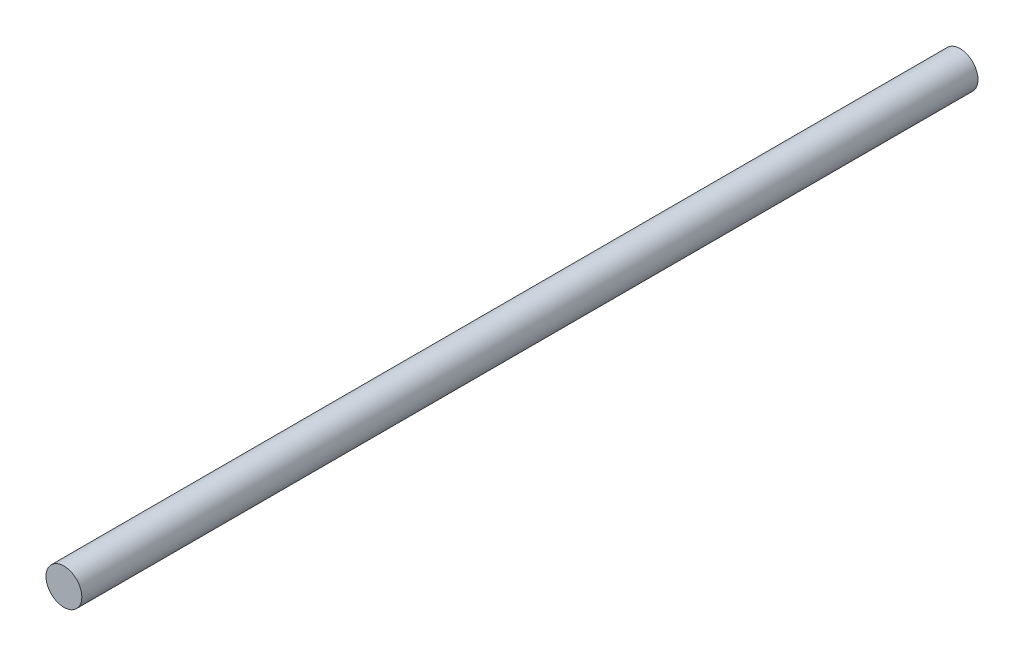
ISO-10303-21;
HEADER;
FILE_DESCRIPTION(('STEP AP214'),'2;1');
FILE_NAME('part.step','',(''),(''),'','','');
FILE_SCHEMA(('AUTOMOTIVE_DESIGN { 1 0 10303 214 1 1 1 1 }'));
ENDSEC;
DATA;
#1=APPLICATION_CONTEXT('core data for automotive mechanical design processes');
#2=APPLICATION_PROTOCOL_DEFINITION('international standard','automotive_design',2000,#1);
#3=PRODUCT_CONTEXT('',#1,'mechanical');
#4=PRODUCT('Part','Part','',(#3));
#5=PRODUCT_RELATED_PRODUCT_CATEGORY('part','',(#4));
#6=PRODUCT_DEFINITION_FORMATION('','',#4);
#7=PRODUCT_DEFINITION_CONTEXT('part definition',#1,'design');
#8=PRODUCT_DEFINITION('design','',#6,#7);
#9=PRODUCT_DEFINITION_SHAPE('','',#8);
#10=(LENGTH_UNIT() NAMED_UNIT(*) SI_UNIT(.MILLI.,.METRE.));
#11=(NAMED_UNIT(*) PLANE_ANGLE_UNIT() SI_UNIT($,.RADIAN.));
#12=(NAMED_UNIT(*) SI_UNIT($,.STERADIAN.) SOLID_ANGLE_UNIT());
#13=UNCERTAINTY_MEASURE_WITH_UNIT(LENGTH_MEASURE(1.E-05),#10,'distance_accuracy_value','');
#14=(GEOMETRIC_REPRESENTATION_CONTEXT(3) GLOBAL_UNCERTAINTY_ASSIGNED_CONTEXT((#13)) GLOBAL_UNIT_ASSIGNED_CONTEXT((#10,
#11,#12)) REPRESENTATION_CONTEXT('',''));
#15=CARTESIAN_POINT('',(0.,0.,0.));
#16=DIRECTION('',(0.,0.,1.));
#17=DIRECTION('',(1.,0.,0.));
#18=AXIS2_PLACEMENT_3D('',#15,#16,#17);
#19=CARTESIAN_POINT('',(0.,0.,100.));
#20=DIRECTION('',(0.,0.,-1.));
#21=DIRECTION('',(-1.,0.,0.));
#22=AXIS2_PLACEMENT_3D('',#19,#20,#21);
#23=CYLINDRICAL_SURFACE('',#22,2.);
#24=CARTESIAN_POINT('',(0.,0.,100.));
#25=DIRECTION('',(0.,0.,1.));
#26=DIRECTION('',(1.,0.,0.));
#27=AXIS2_PLACEMENT_3D('',#24,#25,#26);
#28=CIRCLE('',#27,2.);
#29=CARTESIAN_POINT('',(2.,0.,100.));
#30=VERTEX_POINT('',#29);
#31=EDGE_CURVE('E10',#30,#30,#28,.T.);
#32=ORIENTED_EDGE('',*,*,#31,.F.);
#33=EDGE_LOOP('',(#32));
#34=FACE_BOUND('',#33,.T.);
#35=CARTESIAN_POINT('',(0.,0.,0.));
#36=DIRECTION('',(0.,0.,1.));
#37=DIRECTION('',(1.,0.,0.));
#38=AXIS2_PLACEMENT_3D('',#35,#36,#37);
#39=CIRCLE('',#38,2.);
#40=CARTESIAN_POINT('',(2.,0.,0.));
#41=VERTEX_POINT('',#40);
#42=EDGE_CURVE('E40',#41,#41,#39,.T.);
#43=ORIENTED_EDGE('',*,*,#42,.T.);
#44=EDGE_LOOP('',(#43));
#45=FACE_BOUND('',#44,.T.);
#46=ADVANCED_FACE('F37',(#34,#45),#23,.T.);
#47=CARTESIAN_POINT('',(0.,0.,100.));
#48=DIRECTION('',(0.,0.,1.));
#49=DIRECTION('',(1.,0.,0.));
#50=AXIS2_PLACEMENT_3D('',#47,#48,#49);
#51=PLANE('',#50);
#52=ORIENTED_EDGE('',*,*,#31,.T.);
#53=EDGE_LOOP('',(#52));
#54=FACE_BOUND('',#53,.T.);
#55=ADVANCED_FACE('F54',(#54),#51,.T.);
#56=CARTESIAN_POINT('',(0.,0.,0.));
#57=DIRECTION('',(0.,0.,1.));
#58=DIRECTION('',(1.,0.,0.));
#59=AXIS2_PLACEMENT_3D('',#56,#57,#58);
#60=PLANE('',#59);
#61=ORIENTED_EDGE('',*,*,#42,.F.);
#62=EDGE_LOOP('',(#61));
#63=FACE_BOUND('',#62,.T.);
#64=ADVANCED_FACE('F52',(#63),#60,.F.);
#65=CLOSED_SHELL('',(#46,#55,#64));
#66=MANIFOLD_SOLID_BREP('B2',#65);
#67=ADVANCED_BREP_SHAPE_REPRESENTATION('',(#18,#66),#14);
#68=SHAPE_DEFINITION_REPRESENTATION(#9,#67);
ENDSEC;
END-ISO-10303-21;
